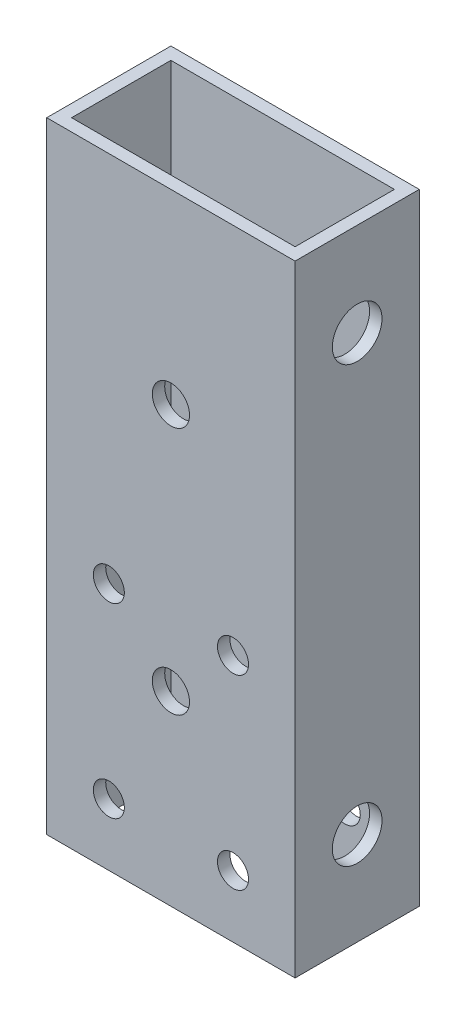
ISO-10303-21;
HEADER;
FILE_DESCRIPTION(('STEP AP214'),'2;1');
FILE_NAME('part.step','',(''),(''),'','','');
FILE_SCHEMA(('AUTOMOTIVE_DESIGN { 1 0 10303 214 1 1 1 1 }'));
ENDSEC;
DATA;
#1=APPLICATION_CONTEXT('core data for automotive mechanical design processes');
#2=APPLICATION_PROTOCOL_DEFINITION('international standard','automotive_design',2000,#1);
#3=PRODUCT_CONTEXT('',#1,'mechanical');
#4=PRODUCT('Part','Part','',(#3));
#5=PRODUCT_RELATED_PRODUCT_CATEGORY('part','',(#4));
#6=PRODUCT_DEFINITION_FORMATION('','',#4);
#7=PRODUCT_DEFINITION_CONTEXT('part definition',#1,'design');
#8=PRODUCT_DEFINITION('design','',#6,#7);
#9=PRODUCT_DEFINITION_SHAPE('','',#8);
#10=(LENGTH_UNIT() NAMED_UNIT(*) SI_UNIT(.MILLI.,.METRE.));
#11=(NAMED_UNIT(*) PLANE_ANGLE_UNIT() SI_UNIT($,.RADIAN.));
#12=(NAMED_UNIT(*) SI_UNIT($,.STERADIAN.) SOLID_ANGLE_UNIT());
#13=UNCERTAINTY_MEASURE_WITH_UNIT(LENGTH_MEASURE(1.E-05),#10,'distance_accuracy_value','');
#14=(GEOMETRIC_REPRESENTATION_CONTEXT(3) GLOBAL_UNCERTAINTY_ASSIGNED_CONTEXT((#13)) GLOBAL_UNIT_ASSIGNED_CONTEXT((#10,
#11,#12)) REPRESENTATION_CONTEXT('',''));
#15=CARTESIAN_POINT('',(0.,0.,0.));
#16=DIRECTION('',(0.,0.,1.));
#17=DIRECTION('',(1.,0.,0.));
#18=AXIS2_PLACEMENT_3D('',#15,#16,#17);
#19=CARTESIAN_POINT('',(0.,100.,0.));
#20=DIRECTION('',(0.,-1.,0.));
#21=DIRECTION('',(0.,0.,-1.));
#22=AXIS2_PLACEMENT_3D('',#19,#20,#21);
#23=PLANE('',#22);
#24=DIRECTION('',(0.,0.,1.));
#25=VECTOR('',#24,1.);
#26=CARTESIAN_POINT('',(0.,100.,0.));
#27=LINE('',#26,#25);
#28=CARTESIAN_POINT('',(0.,100.,-20.));
#29=VERTEX_POINT('',#28);
#30=CARTESIAN_POINT('',(0.,100.,0.));
#31=VERTEX_POINT('',#30);
#32=EDGE_CURVE('E139',#29,#31,#27,.T.);
#33=ORIENTED_EDGE('',*,*,#32,.T.);
#34=DIRECTION('',(1.,0.,0.));
#35=VECTOR('',#34,1.);
#36=CARTESIAN_POINT('',(0.,100.,0.));
#37=LINE('',#36,#35);
#38=CARTESIAN_POINT('',(40.,100.,0.));
#39=VERTEX_POINT('',#38);
#40=EDGE_CURVE('E142',#31,#39,#37,.T.);
#41=ORIENTED_EDGE('',*,*,#40,.T.);
#42=DIRECTION('',(0.,0.,-1.));
#43=VECTOR('',#42,1.);
#44=CARTESIAN_POINT('',(40.,100.,0.));
#45=LINE('',#44,#43);
#46=CARTESIAN_POINT('',(40.,100.,-20.));
#47=VERTEX_POINT('',#46);
#48=EDGE_CURVE('E145',#39,#47,#45,.T.);
#49=ORIENTED_EDGE('',*,*,#48,.T.);
#50=DIRECTION('',(-1.,0.,0.));
#51=VECTOR('',#50,1.);
#52=CARTESIAN_POINT('',(0.,100.,-20.));
#53=LINE('',#52,#51);
#54=EDGE_CURVE('E147',#47,#29,#53,.T.);
#55=ORIENTED_EDGE('',*,*,#54,.T.);
#56=EDGE_LOOP('',(#33,#41,#49,#55));
#57=FACE_BOUND('',#56,.T.);
#58=DIRECTION('',(0.,0.,1.));
#59=VECTOR('',#58,1.);
#60=CARTESIAN_POINT('',(2.,100.,-2.));
#61=LINE('',#60,#59);
#62=CARTESIAN_POINT('',(2.,100.,-18.));
#63=VERTEX_POINT('',#62);
#64=CARTESIAN_POINT('',(2.,100.,-2.));
#65=VERTEX_POINT('',#64);
#66=EDGE_CURVE('E101',#63,#65,#61,.T.);
#67=ORIENTED_EDGE('',*,*,#66,.F.);
#68=DIRECTION('',(-1.,0.,0.));
#69=VECTOR('',#68,1.);
#70=CARTESIAN_POINT('',(2.,100.,-18.));
#71=LINE('',#70,#69);
#72=CARTESIAN_POINT('',(38.,100.,-18.));
#73=VERTEX_POINT('',#72);
#74=EDGE_CURVE('E123',#73,#63,#71,.T.);
#75=ORIENTED_EDGE('',*,*,#74,.F.);
#76=DIRECTION('',(0.,0.,-1.));
#77=VECTOR('',#76,1.);
#78=CARTESIAN_POINT('',(38.,100.,-2.));
#79=LINE('',#78,#77);
#80=CARTESIAN_POINT('',(38.,100.,-2.));
#81=VERTEX_POINT('',#80);
#82=EDGE_CURVE('E121',#81,#73,#79,.T.);
#83=ORIENTED_EDGE('',*,*,#82,.F.);
#84=DIRECTION('',(1.,0.,0.));
#85=VECTOR('',#84,1.);
#86=CARTESIAN_POINT('',(2.,100.,-2.));
#87=LINE('',#86,#85);
#88=EDGE_CURVE('E109',#65,#81,#87,.T.);
#89=ORIENTED_EDGE('',*,*,#88,.F.);
#90=EDGE_LOOP('',(#67,#75,#83,#89));
#91=FACE_BOUND('',#90,.T.);
#92=ADVANCED_FACE('F34',(#57,#91),#23,.F.);
#93=CARTESIAN_POINT('',(0.,0.,0.));
#94=DIRECTION('',(0.,-1.,0.));
#95=DIRECTION('',(0.,0.,-1.));
#96=AXIS2_PLACEMENT_3D('',#93,#94,#95);
#97=PLANE('',#96);
#98=DIRECTION('',(0.,0.,1.));
#99=VECTOR('',#98,1.);
#100=CARTESIAN_POINT('',(0.,0.,0.));
#101=LINE('',#100,#99);
#102=CARTESIAN_POINT('',(0.,0.,-20.));
#103=VERTEX_POINT('',#102);
#104=CARTESIAN_POINT('',(0.,0.,0.));
#105=VERTEX_POINT('',#104);
#106=EDGE_CURVE('E117',#103,#105,#101,.T.);
#107=ORIENTED_EDGE('',*,*,#106,.F.);
#108=DIRECTION('',(-1.,0.,0.));
#109=VECTOR('',#108,1.);
#110=CARTESIAN_POINT('',(0.,0.,-20.));
#111=LINE('',#110,#109);
#112=CARTESIAN_POINT('',(40.,0.,-20.));
#113=VERTEX_POINT('',#112);
#114=EDGE_CURVE('E143',#113,#103,#111,.T.);
#115=ORIENTED_EDGE('',*,*,#114,.F.);
#116=DIRECTION('',(0.,0.,-1.));
#117=VECTOR('',#116,1.);
#118=CARTESIAN_POINT('',(40.,0.,0.));
#119=LINE('',#118,#117);
#120=CARTESIAN_POINT('',(40.,0.,0.));
#121=VERTEX_POINT('',#120);
#122=EDGE_CURVE('E154',#121,#113,#119,.T.);
#123=ORIENTED_EDGE('',*,*,#122,.F.);
#124=DIRECTION('',(1.,0.,0.));
#125=VECTOR('',#124,1.);
#126=CARTESIAN_POINT('',(0.,0.,0.));
#127=LINE('',#126,#125);
#128=EDGE_CURVE('E152',#105,#121,#127,.T.);
#129=ORIENTED_EDGE('',*,*,#128,.F.);
#130=EDGE_LOOP('',(#107,#115,#123,#129));
#131=FACE_BOUND('',#130,.T.);
#132=DIRECTION('',(-1.,0.,0.));
#133=VECTOR('',#132,1.);
#134=CARTESIAN_POINT('',(2.,0.,-18.));
#135=LINE('',#134,#133);
#136=CARTESIAN_POINT('',(38.,0.,-18.));
#137=VERTEX_POINT('',#136);
#138=CARTESIAN_POINT('',(2.,0.,-18.));
#139=VERTEX_POINT('',#138);
#140=EDGE_CURVE('E110',#137,#139,#135,.T.);
#141=ORIENTED_EDGE('',*,*,#140,.T.);
#142=DIRECTION('',(0.,0.,1.));
#143=VECTOR('',#142,1.);
#144=CARTESIAN_POINT('',(2.,0.,-2.));
#145=LINE('',#144,#143);
#146=CARTESIAN_POINT('',(2.,0.,-2.));
#147=VERTEX_POINT('',#146);
#148=EDGE_CURVE('E59',#139,#147,#145,.T.);
#149=ORIENTED_EDGE('',*,*,#148,.T.);
#150=DIRECTION('',(1.,0.,0.));
#151=VECTOR('',#150,1.);
#152=CARTESIAN_POINT('',(2.,0.,-2.));
#153=LINE('',#152,#151);
#154=CARTESIAN_POINT('',(38.,0.,-2.));
#155=VERTEX_POINT('',#154);
#156=EDGE_CURVE('E116',#147,#155,#153,.T.);
#157=ORIENTED_EDGE('',*,*,#156,.T.);
#158=DIRECTION('',(0.,0.,-1.));
#159=VECTOR('',#158,1.);
#160=CARTESIAN_POINT('',(38.,0.,-2.));
#161=LINE('',#160,#159);
#162=EDGE_CURVE('E131',#155,#137,#161,.T.);
#163=ORIENTED_EDGE('',*,*,#162,.T.);
#164=EDGE_LOOP('',(#141,#149,#157,#163));
#165=FACE_BOUND('',#164,.T.);
#166=ADVANCED_FACE('F241',(#131,#165),#97,.T.);
#167=CARTESIAN_POINT('',(0.,100.,0.));
#168=DIRECTION('',(1.,0.,0.));
#169=DIRECTION('',(0.,0.,-1.));
#170=AXIS2_PLACEMENT_3D('',#167,#168,#169);
#171=PLANE('',#170);
#172=CARTESIAN_POINT('',(0.,85.,-10.));
#173=DIRECTION('',(1.,0.,0.));
#174=DIRECTION('',(0.,0.,-1.));
#175=AXIS2_PLACEMENT_3D('',#172,#173,#174);
#176=CIRCLE('',#175,4.);
#177=CARTESIAN_POINT('',(0.,85.,-14.));
#178=VERTEX_POINT('',#177);
#179=EDGE_CURVE('E172',#178,#178,#176,.F.);
#180=ORIENTED_EDGE('',*,*,#179,.F.);
#181=EDGE_LOOP('',(#180));
#182=FACE_BOUND('',#181,.T.);
#183=CARTESIAN_POINT('',(0.,15.,-10.));
#184=DIRECTION('',(1.,0.,0.));
#185=DIRECTION('',(0.,0.,-1.));
#186=AXIS2_PLACEMENT_3D('',#183,#184,#185);
#187=CIRCLE('',#186,4.);
#188=CARTESIAN_POINT('',(0.,15.,-14.));
#189=VERTEX_POINT('',#188);
#190=EDGE_CURVE('E167',#189,#189,#187,.F.);
#191=ORIENTED_EDGE('',*,*,#190,.F.);
#192=EDGE_LOOP('',(#191));
#193=FACE_BOUND('',#192,.T.);
#194=ORIENTED_EDGE('',*,*,#106,.T.);
#195=DIRECTION('',(0.,-1.,0.));
#196=VECTOR('',#195,1.);
#197=CARTESIAN_POINT('',(0.,100.,0.));
#198=LINE('',#197,#196);
#199=EDGE_CURVE('E11',#31,#105,#198,.T.);
#200=ORIENTED_EDGE('',*,*,#199,.F.);
#201=ORIENTED_EDGE('',*,*,#32,.F.);
#202=DIRECTION('',(0.,-1.,0.));
#203=VECTOR('',#202,1.);
#204=CARTESIAN_POINT('',(0.,100.,-20.));
#205=LINE('',#204,#203);
#206=EDGE_CURVE('E149',#29,#103,#205,.T.);
#207=ORIENTED_EDGE('',*,*,#206,.T.);
#208=EDGE_LOOP('',(#194,#200,#201,#207));
#209=FACE_BOUND('',#208,.T.);
#210=ADVANCED_FACE('F36',(#182,#193,#209),#171,.F.);
#211=CARTESIAN_POINT('',(0.,100.,0.));
#212=DIRECTION('',(0.,0.,-1.));
#213=DIRECTION('',(-1.,0.,0.));
#214=AXIS2_PLACEMENT_3D('',#211,#212,#213);
#215=PLANE('',#214);
#216=CARTESIAN_POINT('',(20.,70.,0.));
#217=DIRECTION('',(0.,0.,1.));
#218=DIRECTION('',(-1.,0.,0.));
#219=AXIS2_PLACEMENT_3D('',#216,#217,#218);
#220=CIRCLE('',#219,3.);
#221=CARTESIAN_POINT('',(17.,70.,0.));
#222=VERTEX_POINT('',#221);
#223=EDGE_CURVE('E261',#222,#222,#220,.T.);
#224=ORIENTED_EDGE('',*,*,#223,.F.);
#225=EDGE_LOOP('',(#224));
#226=FACE_BOUND('',#225,.T.);
#227=CARTESIAN_POINT('',(20.,30.,0.));
#228=DIRECTION('',(0.,0.,1.));
#229=DIRECTION('',(1.,0.,0.));
#230=AXIS2_PLACEMENT_3D('',#227,#228,#229);
#231=CIRCLE('',#230,3.);
#232=CARTESIAN_POINT('',(23.,30.,0.));
#233=VERTEX_POINT('',#232);
#234=EDGE_CURVE('E265',#233,#233,#231,.T.);
#235=ORIENTED_EDGE('',*,*,#234,.F.);
#236=EDGE_LOOP('',(#235));
#237=FACE_BOUND('',#236,.T.);
#238=CARTESIAN_POINT('',(30.,9.99999999999999,0.));
#239=DIRECTION('',(0.,0.,1.));
#240=DIRECTION('',(1.,0.,0.));
#241=AXIS2_PLACEMENT_3D('',#238,#239,#240);
#242=CIRCLE('',#241,2.5);
#243=CARTESIAN_POINT('',(32.5,9.99999999999999,0.));
#244=VERTEX_POINT('',#243);
#245=EDGE_CURVE('E269',#244,#244,#242,.T.);
#246=ORIENTED_EDGE('',*,*,#245,.F.);
#247=EDGE_LOOP('',(#246));
#248=FACE_BOUND('',#247,.T.);
#249=CARTESIAN_POINT('',(29.9999999999999,40.,0.));
#250=DIRECTION('',(0.,0.,1.));
#251=DIRECTION('',(1.,0.,0.));
#252=AXIS2_PLACEMENT_3D('',#249,#250,#251);
#253=CIRCLE('',#252,2.5);
#254=CARTESIAN_POINT('',(32.4999999999999,40.,0.));
#255=VERTEX_POINT('',#254);
#256=EDGE_CURVE('E273',#255,#255,#253,.T.);
#257=ORIENTED_EDGE('',*,*,#256,.F.);
#258=EDGE_LOOP('',(#257));
#259=FACE_BOUND('',#258,.T.);
#260=CARTESIAN_POINT('',(9.9999999999999,40.,0.));
#261=DIRECTION('',(0.,0.,1.));
#262=DIRECTION('',(1.,0.,0.));
#263=AXIS2_PLACEMENT_3D('',#260,#261,#262);
#264=CIRCLE('',#263,2.5);
#265=CARTESIAN_POINT('',(12.4999999999999,40.,0.));
#266=VERTEX_POINT('',#265);
#267=EDGE_CURVE('E277',#266,#266,#264,.T.);
#268=ORIENTED_EDGE('',*,*,#267,.F.);
#269=EDGE_LOOP('',(#268));
#270=FACE_BOUND('',#269,.T.);
#271=CARTESIAN_POINT('',(10.,9.99999999999999,0.));
#272=DIRECTION('',(0.,0.,1.));
#273=DIRECTION('',(1.,0.,0.));
#274=AXIS2_PLACEMENT_3D('',#271,#272,#273);
#275=CIRCLE('',#274,2.5);
#276=CARTESIAN_POINT('',(12.5,9.99999999999999,0.));
#277=VERTEX_POINT('',#276);
#278=EDGE_CURVE('E200',#277,#277,#275,.T.);
#279=ORIENTED_EDGE('',*,*,#278,.F.);
#280=EDGE_LOOP('',(#279));
#281=FACE_BOUND('',#280,.T.);
#282=ORIENTED_EDGE('',*,*,#128,.T.);
#283=DIRECTION('',(0.,-1.,0.));
#284=VECTOR('',#283,1.);
#285=CARTESIAN_POINT('',(40.,100.,0.));
#286=LINE('',#285,#284);
#287=EDGE_CURVE('E43',#39,#121,#286,.T.);
#288=ORIENTED_EDGE('',*,*,#287,.F.);
#289=ORIENTED_EDGE('',*,*,#40,.F.);
#290=ORIENTED_EDGE('',*,*,#199,.T.);
#291=EDGE_LOOP('',(#282,#288,#289,#290));
#292=FACE_BOUND('',#291,.T.);
#293=ADVANCED_FACE('F250',(#226,#237,#248,#259,#270,#281,#292),#215,.F.);
#294=CARTESIAN_POINT('',(40.,100.,0.));
#295=DIRECTION('',(-1.,0.,0.));
#296=DIRECTION('',(0.,0.,1.));
#297=AXIS2_PLACEMENT_3D('',#294,#295,#296);
#298=PLANE('',#297);
#299=CARTESIAN_POINT('',(40.,85.,-10.));
#300=DIRECTION('',(1.,0.,0.));
#301=DIRECTION('',(0.,0.,1.));
#302=AXIS2_PLACEMENT_3D('',#299,#300,#301);
#303=CIRCLE('',#302,4.);
#304=CARTESIAN_POINT('',(40.,85.,-6.));
#305=VERTEX_POINT('',#304);
#306=EDGE_CURVE('E207',#305,#305,#303,.T.);
#307=ORIENTED_EDGE('',*,*,#306,.F.);
#308=EDGE_LOOP('',(#307));
#309=FACE_BOUND('',#308,.T.);
#310=CARTESIAN_POINT('',(40.,15.,-10.));
#311=DIRECTION('',(1.,0.,0.));
#312=DIRECTION('',(0.,0.,-1.));
#313=AXIS2_PLACEMENT_3D('',#310,#311,#312);
#314=CIRCLE('',#313,4.);
#315=CARTESIAN_POINT('',(40.,15.,-14.));
#316=VERTEX_POINT('',#315);
#317=EDGE_CURVE('E214',#316,#316,#314,.T.);
#318=ORIENTED_EDGE('',*,*,#317,.F.);
#319=EDGE_LOOP('',(#318));
#320=FACE_BOUND('',#319,.T.);
#321=ORIENTED_EDGE('',*,*,#122,.T.);
#322=DIRECTION('',(0.,-1.,0.));
#323=VECTOR('',#322,1.);
#324=CARTESIAN_POINT('',(40.,100.,-20.));
#325=LINE('',#324,#323);
#326=EDGE_CURVE('E159',#47,#113,#325,.T.);
#327=ORIENTED_EDGE('',*,*,#326,.F.);
#328=ORIENTED_EDGE('',*,*,#48,.F.);
#329=ORIENTED_EDGE('',*,*,#287,.T.);
#330=EDGE_LOOP('',(#321,#327,#328,#329));
#331=FACE_BOUND('',#330,.T.);
#332=ADVANCED_FACE('F235',(#309,#320,#331),#298,.F.);
#333=CARTESIAN_POINT('',(0.,100.,-20.));
#334=DIRECTION('',(0.,0.,1.));
#335=DIRECTION('',(1.,0.,0.));
#336=AXIS2_PLACEMENT_3D('',#333,#334,#335);
#337=PLANE('',#336);
#338=CARTESIAN_POINT('',(30.,9.99999999999999,-20.));
#339=DIRECTION('',(0.,0.,1.));
#340=DIRECTION('',(1.,0.,0.));
#341=AXIS2_PLACEMENT_3D('',#338,#339,#340);
#342=CIRCLE('',#341,2.5);
#343=CARTESIAN_POINT('',(32.5,9.99999999999999,-20.));
#344=VERTEX_POINT('',#343);
#345=EDGE_CURVE('E181',#344,#344,#342,.F.);
#346=ORIENTED_EDGE('',*,*,#345,.F.);
#347=EDGE_LOOP('',(#346));
#348=FACE_BOUND('',#347,.T.);
#349=CARTESIAN_POINT('',(29.9999999999999,40.,-20.));
#350=DIRECTION('',(0.,0.,1.));
#351=DIRECTION('',(1.,0.,0.));
#352=AXIS2_PLACEMENT_3D('',#349,#350,#351);
#353=CIRCLE('',#352,2.5);
#354=CARTESIAN_POINT('',(32.4999999999999,40.,-20.));
#355=VERTEX_POINT('',#354);
#356=EDGE_CURVE('E356',#355,#355,#353,.F.);
#357=ORIENTED_EDGE('',*,*,#356,.F.);
#358=EDGE_LOOP('',(#357));
#359=FACE_BOUND('',#358,.T.);
#360=CARTESIAN_POINT('',(9.9999999999999,40.,-20.));
#361=DIRECTION('',(0.,0.,1.));
#362=DIRECTION('',(1.,0.,0.));
#363=AXIS2_PLACEMENT_3D('',#360,#361,#362);
#364=CIRCLE('',#363,2.5);
#365=CARTESIAN_POINT('',(12.4999999999999,40.,-20.));
#366=VERTEX_POINT('',#365);
#367=EDGE_CURVE('E194',#366,#366,#364,.F.);
#368=ORIENTED_EDGE('',*,*,#367,.F.);
#369=EDGE_LOOP('',(#368));
#370=FACE_BOUND('',#369,.T.);
#371=CARTESIAN_POINT('',(10.,9.99999999999999,-20.));
#372=DIRECTION('',(0.,0.,1.));
#373=DIRECTION('',(1.,0.,0.));
#374=AXIS2_PLACEMENT_3D('',#371,#372,#373);
#375=CIRCLE('',#374,2.5);
#376=CARTESIAN_POINT('',(12.5,9.99999999999999,-20.));
#377=VERTEX_POINT('',#376);
#378=EDGE_CURVE('E177',#377,#377,#375,.F.);
#379=ORIENTED_EDGE('',*,*,#378,.F.);
#380=EDGE_LOOP('',(#379));
#381=FACE_BOUND('',#380,.T.);
#382=ORIENTED_EDGE('',*,*,#114,.T.);
#383=ORIENTED_EDGE('',*,*,#206,.F.);
#384=ORIENTED_EDGE('',*,*,#54,.F.);
#385=ORIENTED_EDGE('',*,*,#326,.T.);
#386=EDGE_LOOP('',(#382,#383,#384,#385));
#387=FACE_BOUND('',#386,.T.);
#388=ADVANCED_FACE('F225',(#348,#359,#370,#381,#387),#337,.F.);
#389=CARTESIAN_POINT('',(2.,100.,-2.));
#390=DIRECTION('',(1.,0.,0.));
#391=DIRECTION('',(0.,0.,-1.));
#392=AXIS2_PLACEMENT_3D('',#389,#390,#391);
#393=PLANE('',#392);
#394=CARTESIAN_POINT('',(2.,85.,-10.));
#395=DIRECTION('',(1.,0.,0.));
#396=DIRECTION('',(0.,0.,-1.));
#397=AXIS2_PLACEMENT_3D('',#394,#395,#396);
#398=CIRCLE('',#397,4.);
#399=CARTESIAN_POINT('',(2.,85.,-14.));
#400=VERTEX_POINT('',#399);
#401=EDGE_CURVE('E171',#400,#400,#398,.T.);
#402=ORIENTED_EDGE('',*,*,#401,.F.);
#403=EDGE_LOOP('',(#402));
#404=FACE_BOUND('',#403,.T.);
#405=CARTESIAN_POINT('',(2.,15.,-10.));
#406=DIRECTION('',(1.,0.,0.));
#407=DIRECTION('',(0.,0.,-1.));
#408=AXIS2_PLACEMENT_3D('',#405,#406,#407);
#409=CIRCLE('',#408,4.);
#410=CARTESIAN_POINT('',(2.,15.,-14.));
#411=VERTEX_POINT('',#410);
#412=EDGE_CURVE('E129',#411,#411,#409,.T.);
#413=ORIENTED_EDGE('',*,*,#412,.F.);
#414=EDGE_LOOP('',(#413));
#415=FACE_BOUND('',#414,.T.);
#416=ORIENTED_EDGE('',*,*,#148,.F.);
#417=DIRECTION('',(0.,-1.,0.));
#418=VECTOR('',#417,1.);
#419=CARTESIAN_POINT('',(2.,100.,-18.));
#420=LINE('',#419,#418);
#421=EDGE_CURVE('E105',#63,#139,#420,.T.);
#422=ORIENTED_EDGE('',*,*,#421,.F.);
#423=ORIENTED_EDGE('',*,*,#66,.T.);
#424=DIRECTION('',(0.,-1.,0.));
#425=VECTOR('',#424,1.);
#426=CARTESIAN_POINT('',(2.,100.,-2.));
#427=LINE('',#426,#425);
#428=EDGE_CURVE('E104',#65,#147,#427,.T.);
#429=ORIENTED_EDGE('',*,*,#428,.T.);
#430=EDGE_LOOP('',(#416,#422,#423,#429));
#431=FACE_BOUND('',#430,.T.);
#432=ADVANCED_FACE('F103',(#404,#415,#431),#393,.T.);
#433=CARTESIAN_POINT('',(2.,100.,-2.));
#434=DIRECTION('',(0.,0.,-1.));
#435=DIRECTION('',(-1.,0.,0.));
#436=AXIS2_PLACEMENT_3D('',#433,#434,#435);
#437=PLANE('',#436);
#438=CARTESIAN_POINT('',(20.,70.,-2.));
#439=DIRECTION('',(0.,0.,-1.));
#440=DIRECTION('',(-1.,0.,0.));
#441=AXIS2_PLACEMENT_3D('',#438,#439,#440);
#442=CIRCLE('',#441,3.);
#443=CARTESIAN_POINT('',(17.,70.,-2.));
#444=VERTEX_POINT('',#443);
#445=EDGE_CURVE('E347',#444,#444,#442,.F.);
#446=ORIENTED_EDGE('',*,*,#445,.T.);
#447=EDGE_LOOP('',(#446));
#448=FACE_BOUND('',#447,.T.);
#449=CARTESIAN_POINT('',(20.,30.,-2.));
#450=DIRECTION('',(0.,0.,-1.));
#451=DIRECTION('',(-1.,0.,0.));
#452=AXIS2_PLACEMENT_3D('',#449,#450,#451);
#453=CIRCLE('',#452,3.);
#454=CARTESIAN_POINT('',(17.,30.,-2.));
#455=VERTEX_POINT('',#454);
#456=EDGE_CURVE('E349',#455,#455,#453,.F.);
#457=ORIENTED_EDGE('',*,*,#456,.T.);
#458=EDGE_LOOP('',(#457));
#459=FACE_BOUND('',#458,.T.);
#460=CARTESIAN_POINT('',(30.,9.99999999999999,-2.));
#461=DIRECTION('',(0.,0.,-1.));
#462=DIRECTION('',(-1.,0.,0.));
#463=AXIS2_PLACEMENT_3D('',#460,#461,#462);
#464=CIRCLE('',#463,2.5);
#465=CARTESIAN_POINT('',(27.5,9.99999999999999,-2.));
#466=VERTEX_POINT('',#465);
#467=EDGE_CURVE('E197',#466,#466,#464,.T.);
#468=ORIENTED_EDGE('',*,*,#467,.F.);
#469=EDGE_LOOP('',(#468));
#470=FACE_BOUND('',#469,.T.);
#471=CARTESIAN_POINT('',(29.9999999999999,40.,-2.));
#472=DIRECTION('',(0.,0.,-1.));
#473=DIRECTION('',(-1.,0.,0.));
#474=AXIS2_PLACEMENT_3D('',#471,#472,#473);
#475=CIRCLE('',#474,2.5);
#476=CARTESIAN_POINT('',(27.4999999999999,40.,-2.));
#477=VERTEX_POINT('',#476);
#478=EDGE_CURVE('E184',#477,#477,#475,.T.);
#479=ORIENTED_EDGE('',*,*,#478,.F.);
#480=EDGE_LOOP('',(#479));
#481=FACE_BOUND('',#480,.T.);
#482=CARTESIAN_POINT('',(9.9999999999999,40.,-2.));
#483=DIRECTION('',(0.,0.,-1.));
#484=DIRECTION('',(-1.,0.,0.));
#485=AXIS2_PLACEMENT_3D('',#482,#483,#484);
#486=CIRCLE('',#485,2.5);
#487=CARTESIAN_POINT('',(7.4999999999999,40.,-2.));
#488=VERTEX_POINT('',#487);
#489=EDGE_CURVE('E180',#488,#488,#486,.T.);
#490=ORIENTED_EDGE('',*,*,#489,.F.);
#491=EDGE_LOOP('',(#490));
#492=FACE_BOUND('',#491,.T.);
#493=CARTESIAN_POINT('',(10.,9.99999999999999,-2.));
#494=DIRECTION('',(0.,0.,-1.));
#495=DIRECTION('',(-1.,0.,0.));
#496=AXIS2_PLACEMENT_3D('',#493,#494,#495);
#497=CIRCLE('',#496,2.5);
#498=CARTESIAN_POINT('',(7.5,9.99999999999999,-2.));
#499=VERTEX_POINT('',#498);
#500=EDGE_CURVE('E176',#499,#499,#497,.T.);
#501=ORIENTED_EDGE('',*,*,#500,.F.);
#502=EDGE_LOOP('',(#501));
#503=FACE_BOUND('',#502,.T.);
#504=ORIENTED_EDGE('',*,*,#156,.F.);
#505=ORIENTED_EDGE('',*,*,#428,.F.);
#506=ORIENTED_EDGE('',*,*,#88,.T.);
#507=DIRECTION('',(0.,-1.,0.));
#508=VECTOR('',#507,1.);
#509=CARTESIAN_POINT('',(38.,100.,-2.));
#510=LINE('',#509,#508);
#511=EDGE_CURVE('E118',#81,#155,#510,.T.);
#512=ORIENTED_EDGE('',*,*,#511,.T.);
#513=EDGE_LOOP('',(#504,#505,#506,#512));
#514=FACE_BOUND('',#513,.T.);
#515=ADVANCED_FACE('F113',(#448,#459,#470,#481,#492,#503,#514),#437,.T.);
#516=CARTESIAN_POINT('',(38.,100.,-2.));
#517=DIRECTION('',(-1.,0.,0.));
#518=DIRECTION('',(0.,0.,1.));
#519=AXIS2_PLACEMENT_3D('',#516,#517,#518);
#520=PLANE('',#519);
#521=CARTESIAN_POINT('',(38.,85.,-10.));
#522=DIRECTION('',(-1.,0.,0.));
#523=DIRECTION('',(0.,0.,1.));
#524=AXIS2_PLACEMENT_3D('',#521,#522,#523);
#525=CIRCLE('',#524,4.);
#526=CARTESIAN_POINT('',(38.,85.,-6.));
#527=VERTEX_POINT('',#526);
#528=EDGE_CURVE('E168',#527,#527,#525,.T.);
#529=ORIENTED_EDGE('',*,*,#528,.F.);
#530=EDGE_LOOP('',(#529));
#531=FACE_BOUND('',#530,.T.);
#532=CARTESIAN_POINT('',(38.,15.,-10.));
#533=DIRECTION('',(-1.,0.,0.));
#534=DIRECTION('',(0.,0.,1.));
#535=AXIS2_PLACEMENT_3D('',#532,#533,#534);
#536=CIRCLE('',#535,4.);
#537=CARTESIAN_POINT('',(38.,15.,-6.));
#538=VERTEX_POINT('',#537);
#539=EDGE_CURVE('E164',#538,#538,#536,.T.);
#540=ORIENTED_EDGE('',*,*,#539,.F.);
#541=EDGE_LOOP('',(#540));
#542=FACE_BOUND('',#541,.T.);
#543=ORIENTED_EDGE('',*,*,#162,.F.);
#544=ORIENTED_EDGE('',*,*,#511,.F.);
#545=ORIENTED_EDGE('',*,*,#82,.T.);
#546=DIRECTION('',(0.,-1.,0.));
#547=VECTOR('',#546,1.);
#548=CARTESIAN_POINT('',(38.,100.,-18.));
#549=LINE('',#548,#547);
#550=EDGE_CURVE('E51',#73,#137,#549,.T.);
#551=ORIENTED_EDGE('',*,*,#550,.T.);
#552=EDGE_LOOP('',(#543,#544,#545,#551));
#553=FACE_BOUND('',#552,.T.);
#554=ADVANCED_FACE('F232',(#531,#542,#553),#520,.T.);
#555=CARTESIAN_POINT('',(2.,100.,-18.));
#556=DIRECTION('',(0.,0.,1.));
#557=DIRECTION('',(1.,0.,0.));
#558=AXIS2_PLACEMENT_3D('',#555,#556,#557);
#559=PLANE('',#558);
#560=CARTESIAN_POINT('',(30.,9.99999999999999,-18.));
#561=DIRECTION('',(0.,0.,1.));
#562=DIRECTION('',(1.,0.,0.));
#563=AXIS2_PLACEMENT_3D('',#560,#561,#562);
#564=CIRCLE('',#563,2.5);
#565=CARTESIAN_POINT('',(32.5,9.99999999999999,-18.));
#566=VERTEX_POINT('',#565);
#567=EDGE_CURVE('E38',#566,#566,#564,.T.);
#568=ORIENTED_EDGE('',*,*,#567,.F.);
#569=EDGE_LOOP('',(#568));
#570=FACE_BOUND('',#569,.T.);
#571=CARTESIAN_POINT('',(29.9999999999999,40.,-18.));
#572=DIRECTION('',(0.,0.,1.));
#573=DIRECTION('',(1.,0.,0.));
#574=AXIS2_PLACEMENT_3D('',#571,#572,#573);
#575=CIRCLE('',#574,2.5);
#576=CARTESIAN_POINT('',(32.4999999999999,40.,-18.));
#577=VERTEX_POINT('',#576);
#578=EDGE_CURVE('E182',#577,#577,#575,.T.);
#579=ORIENTED_EDGE('',*,*,#578,.F.);
#580=EDGE_LOOP('',(#579));
#581=FACE_BOUND('',#580,.T.);
#582=CARTESIAN_POINT('',(9.9999999999999,40.,-18.));
#583=DIRECTION('',(0.,0.,1.));
#584=DIRECTION('',(1.,0.,0.));
#585=AXIS2_PLACEMENT_3D('',#582,#583,#584);
#586=CIRCLE('',#585,2.5);
#587=CARTESIAN_POINT('',(12.4999999999999,40.,-18.));
#588=VERTEX_POINT('',#587);
#589=EDGE_CURVE('E178',#588,#588,#586,.T.);
#590=ORIENTED_EDGE('',*,*,#589,.F.);
#591=EDGE_LOOP('',(#590));
#592=FACE_BOUND('',#591,.T.);
#593=CARTESIAN_POINT('',(10.,9.99999999999999,-18.));
#594=DIRECTION('',(0.,0.,1.));
#595=DIRECTION('',(1.,0.,0.));
#596=AXIS2_PLACEMENT_3D('',#593,#594,#595);
#597=CIRCLE('',#596,2.5);
#598=CARTESIAN_POINT('',(12.5,9.99999999999999,-18.));
#599=VERTEX_POINT('',#598);
#600=EDGE_CURVE('E173',#599,#599,#597,.T.);
#601=ORIENTED_EDGE('',*,*,#600,.F.);
#602=EDGE_LOOP('',(#601));
#603=FACE_BOUND('',#602,.T.);
#604=ORIENTED_EDGE('',*,*,#140,.F.);
#605=ORIENTED_EDGE('',*,*,#550,.F.);
#606=ORIENTED_EDGE('',*,*,#74,.T.);
#607=ORIENTED_EDGE('',*,*,#421,.T.);
#608=EDGE_LOOP('',(#604,#605,#606,#607));
#609=FACE_BOUND('',#608,.T.);
#610=ADVANCED_FACE('F295',(#570,#581,#592,#603,#609),#559,.T.);
#611=CARTESIAN_POINT('',(-11.3137084989848,15.,-10.));
#612=DIRECTION('',(1.,0.,0.));
#613=DIRECTION('',(0.,0.,-1.));
#614=AXIS2_PLACEMENT_3D('',#611,#612,#613);
#615=CYLINDRICAL_SURFACE('',#614,4.);
#616=ORIENTED_EDGE('',*,*,#539,.T.);
#617=EDGE_LOOP('',(#616));
#618=FACE_BOUND('',#617,.T.);
#619=ORIENTED_EDGE('',*,*,#317,.T.);
#620=EDGE_LOOP('',(#619));
#621=FACE_BOUND('',#620,.T.);
#622=ADVANCED_FACE('F297',(#618,#621),#615,.F.);
#623=ORIENTED_EDGE('',*,*,#412,.T.);
#624=EDGE_LOOP('',(#623));
#625=FACE_BOUND('',#624,.T.);
#626=ORIENTED_EDGE('',*,*,#190,.T.);
#627=EDGE_LOOP('',(#626));
#628=FACE_BOUND('',#627,.T.);
#629=ADVANCED_FACE('F221',(#625,#628),#615,.F.);
#630=CARTESIAN_POINT('',(-11.3137084989848,85.,-10.));
#631=DIRECTION('',(1.,0.,0.));
#632=DIRECTION('',(0.,0.,-1.));
#633=AXIS2_PLACEMENT_3D('',#630,#631,#632);
#634=CYLINDRICAL_SURFACE('',#633,4.);
#635=ORIENTED_EDGE('',*,*,#528,.T.);
#636=EDGE_LOOP('',(#635));
#637=FACE_BOUND('',#636,.T.);
#638=ORIENTED_EDGE('',*,*,#306,.T.);
#639=EDGE_LOOP('',(#638));
#640=FACE_BOUND('',#639,.T.);
#641=ADVANCED_FACE('F311',(#637,#640),#634,.F.);
#642=ORIENTED_EDGE('',*,*,#401,.T.);
#643=EDGE_LOOP('',(#642));
#644=FACE_BOUND('',#643,.T.);
#645=ORIENTED_EDGE('',*,*,#179,.T.);
#646=EDGE_LOOP('',(#645));
#647=FACE_BOUND('',#646,.T.);
#648=ADVANCED_FACE('F314',(#644,#647),#634,.F.);
#649=CARTESIAN_POINT('',(10.,9.99999999999999,-27.0710678118655));
#650=DIRECTION('',(0.,0.,1.));
#651=DIRECTION('',(1.,0.,0.));
#652=AXIS2_PLACEMENT_3D('',#649,#650,#651);
#653=CYLINDRICAL_SURFACE('',#652,2.5);
#654=ORIENTED_EDGE('',*,*,#600,.T.);
#655=EDGE_LOOP('',(#654));
#656=FACE_BOUND('',#655,.T.);
#657=ORIENTED_EDGE('',*,*,#378,.T.);
#658=EDGE_LOOP('',(#657));
#659=FACE_BOUND('',#658,.T.);
#660=ADVANCED_FACE('F316',(#656,#659),#653,.F.);
#661=ORIENTED_EDGE('',*,*,#500,.T.);
#662=EDGE_LOOP('',(#661));
#663=FACE_BOUND('',#662,.T.);
#664=ORIENTED_EDGE('',*,*,#278,.T.);
#665=EDGE_LOOP('',(#664));
#666=FACE_BOUND('',#665,.T.);
#667=ADVANCED_FACE('F319',(#663,#666),#653,.F.);
#668=CARTESIAN_POINT('',(9.9999999999999,40.,-27.0710678118655));
#669=DIRECTION('',(0.,0.,1.));
#670=DIRECTION('',(1.,0.,0.));
#671=AXIS2_PLACEMENT_3D('',#668,#669,#670);
#672=CYLINDRICAL_SURFACE('',#671,2.5);
#673=ORIENTED_EDGE('',*,*,#589,.T.);
#674=EDGE_LOOP('',(#673));
#675=FACE_BOUND('',#674,.T.);
#676=ORIENTED_EDGE('',*,*,#367,.T.);
#677=EDGE_LOOP('',(#676));
#678=FACE_BOUND('',#677,.T.);
#679=ADVANCED_FACE('F321',(#675,#678),#672,.F.);
#680=CARTESIAN_POINT('',(29.9999999999999,40.,-27.0710678118655));
#681=DIRECTION('',(0.,0.,1.));
#682=DIRECTION('',(1.,0.,0.));
#683=AXIS2_PLACEMENT_3D('',#680,#681,#682);
#684=CYLINDRICAL_SURFACE('',#683,2.5);
#685=ORIENTED_EDGE('',*,*,#578,.T.);
#686=EDGE_LOOP('',(#685));
#687=FACE_BOUND('',#686,.T.);
#688=ORIENTED_EDGE('',*,*,#356,.T.);
#689=EDGE_LOOP('',(#688));
#690=FACE_BOUND('',#689,.T.);
#691=ADVANCED_FACE('F324',(#687,#690),#684,.F.);
#692=CARTESIAN_POINT('',(30.,9.99999999999999,-27.0710678118655));
#693=DIRECTION('',(0.,0.,1.));
#694=DIRECTION('',(1.,0.,0.));
#695=AXIS2_PLACEMENT_3D('',#692,#693,#694);
#696=CYLINDRICAL_SURFACE('',#695,2.5);
#697=ORIENTED_EDGE('',*,*,#567,.T.);
#698=EDGE_LOOP('',(#697));
#699=FACE_BOUND('',#698,.T.);
#700=ORIENTED_EDGE('',*,*,#345,.T.);
#701=EDGE_LOOP('',(#700));
#702=FACE_BOUND('',#701,.T.);
#703=ADVANCED_FACE('F329',(#699,#702),#696,.F.);
#704=ORIENTED_EDGE('',*,*,#489,.T.);
#705=EDGE_LOOP('',(#704));
#706=FACE_BOUND('',#705,.T.);
#707=ORIENTED_EDGE('',*,*,#267,.T.);
#708=EDGE_LOOP('',(#707));
#709=FACE_BOUND('',#708,.T.);
#710=ADVANCED_FACE('F326',(#706,#709),#672,.F.);
#711=ORIENTED_EDGE('',*,*,#478,.T.);
#712=EDGE_LOOP('',(#711));
#713=FACE_BOUND('',#712,.T.);
#714=ORIENTED_EDGE('',*,*,#256,.T.);
#715=EDGE_LOOP('',(#714));
#716=FACE_BOUND('',#715,.T.);
#717=ADVANCED_FACE('F330',(#713,#716),#684,.F.);
#718=ORIENTED_EDGE('',*,*,#467,.T.);
#719=EDGE_LOOP('',(#718));
#720=FACE_BOUND('',#719,.T.);
#721=ORIENTED_EDGE('',*,*,#245,.T.);
#722=EDGE_LOOP('',(#721));
#723=FACE_BOUND('',#722,.T.);
#724=ADVANCED_FACE('F334',(#720,#723),#696,.F.);
#725=CARTESIAN_POINT('',(20.,30.,-10.4852813742386));
#726=DIRECTION('',(0.,0.,1.));
#727=DIRECTION('',(1.,0.,0.));
#728=AXIS2_PLACEMENT_3D('',#725,#726,#727);
#729=CYLINDRICAL_SURFACE('',#728,3.);
#730=ORIENTED_EDGE('',*,*,#234,.T.);
#731=EDGE_LOOP('',(#730));
#732=FACE_BOUND('',#731,.T.);
#733=ORIENTED_EDGE('',*,*,#456,.F.);
#734=EDGE_LOOP('',(#733));
#735=FACE_BOUND('',#734,.T.);
#736=ADVANCED_FACE('F335',(#732,#735),#729,.F.);
#737=CARTESIAN_POINT('',(20.,70.,-10.4852813742386));
#738=DIRECTION('',(0.,0.,1.));
#739=DIRECTION('',(1.,0.,0.));
#740=AXIS2_PLACEMENT_3D('',#737,#738,#739);
#741=CYLINDRICAL_SURFACE('',#740,3.);
#742=ORIENTED_EDGE('',*,*,#223,.T.);
#743=EDGE_LOOP('',(#742));
#744=FACE_BOUND('',#743,.T.);
#745=ORIENTED_EDGE('',*,*,#445,.F.);
#746=EDGE_LOOP('',(#745));
#747=FACE_BOUND('',#746,.T.);
#748=ADVANCED_FACE('F338',(#744,#747),#741,.F.);
#749=CLOSED_SHELL('',(#92,#166,#210,#293,#332,#388,#432,#515,#554,#610,#622,#629,#641,#648,#660,
#667,#679,#691,#703,#710,#717,#724,#736,#748));
#750=MANIFOLD_SOLID_BREP('B2',#749);
#751=ADVANCED_BREP_SHAPE_REPRESENTATION('',(#18,#750),#14);
#752=SHAPE_DEFINITION_REPRESENTATION(#9,#751);
ENDSEC;
END-ISO-10303-21;
